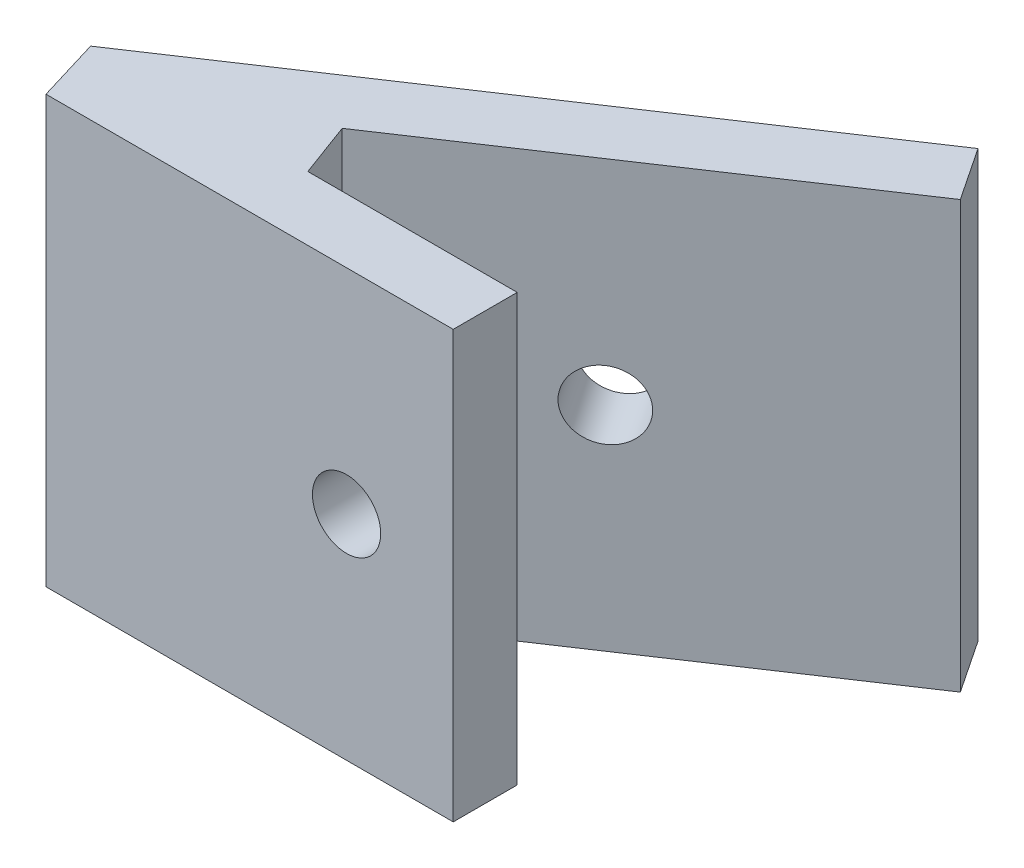
ISO-10303-21;
HEADER;
FILE_DESCRIPTION(('STEP AP214'),'2;1');
FILE_NAME('part.step','',(''),(''),'','','');
FILE_SCHEMA(('AUTOMOTIVE_DESIGN { 1 0 10303 214 1 1 1 1 }'));
ENDSEC;
DATA;
#1=APPLICATION_CONTEXT('core data for automotive mechanical design processes');
#2=APPLICATION_PROTOCOL_DEFINITION('international standard','automotive_design',2000,#1);
#3=PRODUCT_CONTEXT('',#1,'mechanical');
#4=PRODUCT('Part','Part','',(#3));
#5=PRODUCT_RELATED_PRODUCT_CATEGORY('part','',(#4));
#6=PRODUCT_DEFINITION_FORMATION('','',#4);
#7=PRODUCT_DEFINITION_CONTEXT('part definition',#1,'design');
#8=PRODUCT_DEFINITION('design','',#6,#7);
#9=PRODUCT_DEFINITION_SHAPE('','',#8);
#10=(LENGTH_UNIT() NAMED_UNIT(*) SI_UNIT(.MILLI.,.METRE.));
#11=(NAMED_UNIT(*) PLANE_ANGLE_UNIT() SI_UNIT($,.RADIAN.));
#12=(NAMED_UNIT(*) SI_UNIT($,.STERADIAN.) SOLID_ANGLE_UNIT());
#13=UNCERTAINTY_MEASURE_WITH_UNIT(LENGTH_MEASURE(1.E-05),#10,'distance_accuracy_value','');
#14=(GEOMETRIC_REPRESENTATION_CONTEXT(3) GLOBAL_UNCERTAINTY_ASSIGNED_CONTEXT((#13)) GLOBAL_UNIT_ASSIGNED_CONTEXT((#10,
#11,#12)) REPRESENTATION_CONTEXT('',''));
#15=CARTESIAN_POINT('',(0.,0.,0.));
#16=DIRECTION('',(0.,0.,1.));
#17=DIRECTION('',(1.,0.,0.));
#18=AXIS2_PLACEMENT_3D('',#15,#16,#17);
#19=CARTESIAN_POINT('',(22.9929854963961,20.,-80.3307949469992));
#20=DIRECTION('',(-1.,0.,0.));
#21=DIRECTION('',(0.,0.,1.));
#22=AXIS2_PLACEMENT_3D('',#19,#20,#21);
#23=PLANE('',#22);
#24=DIRECTION('',(0.,0.,-1.));
#25=VECTOR('',#24,1.);
#26=CARTESIAN_POINT('',(22.9929854963961,0.,-80.3307949469992));
#27=LINE('',#26,#25);
#28=CARTESIAN_POINT('',(22.9929854963961,0.,-80.3307949469992));
#29=VERTEX_POINT('',#28);
#30=CARTESIAN_POINT('',(22.9929854963961,0.,-83.3307949469992));
#31=VERTEX_POINT('',#30);
#32=EDGE_CURVE('E135',#29,#31,#27,.T.);
#33=ORIENTED_EDGE('',*,*,#32,.T.);
#34=DIRECTION('',(0.,-1.,0.));
#35=VECTOR('',#34,1.);
#36=CARTESIAN_POINT('',(22.9929854963961,20.,-83.3307949469992));
#37=LINE('',#36,#35);
#38=CARTESIAN_POINT('',(22.9929854963961,20.,-83.3307949469992));
#39=VERTEX_POINT('',#38);
#40=EDGE_CURVE('E11',#39,#31,#37,.T.);
#41=ORIENTED_EDGE('',*,*,#40,.F.);
#42=DIRECTION('',(0.,0.,-1.));
#43=VECTOR('',#42,1.);
#44=CARTESIAN_POINT('',(22.9929854963961,20.,-80.3307949469992));
#45=LINE('',#44,#43);
#46=CARTESIAN_POINT('',(22.9929854963961,20.,-80.3307949469992));
#47=VERTEX_POINT('',#46);
#48=EDGE_CURVE('E150',#47,#39,#45,.T.);
#49=ORIENTED_EDGE('',*,*,#48,.F.);
#50=DIRECTION('',(0.,-1.,0.));
#51=VECTOR('',#50,1.);
#52=CARTESIAN_POINT('',(22.9929854963961,20.,-80.3307949469992));
#53=LINE('',#52,#51);
#54=EDGE_CURVE('E131',#47,#29,#53,.T.);
#55=ORIENTED_EDGE('',*,*,#54,.T.);
#56=EDGE_LOOP('',(#33,#41,#49,#55));
#57=FACE_BOUND('',#56,.T.);
#58=ADVANCED_FACE('F39',(#57),#23,.F.);
#59=CARTESIAN_POINT('',(22.9929854963961,20.,-83.3307949469992));
#60=DIRECTION('',(0.,0.,1.));
#61=DIRECTION('',(1.,0.,0.));
#62=AXIS2_PLACEMENT_3D('',#59,#60,#61);
#63=PLANE('',#62);
#64=CARTESIAN_POINT('',(17.9929854963961,10.,-83.3307949469992));
#65=DIRECTION('',(0.,0.,-1.));
#66=DIRECTION('',(-1.,0.,0.));
#67=AXIS2_PLACEMENT_3D('',#64,#65,#66);
#68=CIRCLE('',#67,1.6);
#69=CARTESIAN_POINT('',(16.3929854963961,10.,-83.3307949469992));
#70=VERTEX_POINT('',#69);
#71=EDGE_CURVE('E183',#70,#70,#68,.T.);
#72=ORIENTED_EDGE('',*,*,#71,.F.);
#73=EDGE_LOOP('',(#72));
#74=FACE_BOUND('',#73,.T.);
#75=DIRECTION('',(-1.,0.,0.));
#76=VECTOR('',#75,1.);
#77=CARTESIAN_POINT('',(22.9929854963961,0.,-83.3307949469992));
#78=LINE('',#77,#76);
#79=CARTESIAN_POINT('',(13.1761345150598,0.,-83.3307949469992));
#80=VERTEX_POINT('',#79);
#81=EDGE_CURVE('E138',#31,#80,#78,.T.);
#82=ORIENTED_EDGE('',*,*,#81,.T.);
#83=DIRECTION('',(0.,-1.,0.));
#84=VECTOR('',#83,1.);
#85=CARTESIAN_POINT('',(13.1761345150598,20.,-83.3307949469992));
#86=LINE('',#85,#84);
#87=CARTESIAN_POINT('',(13.1761345150598,20.,-83.3307949469992));
#88=VERTEX_POINT('',#87);
#89=EDGE_CURVE('E47',#88,#80,#86,.T.);
#90=ORIENTED_EDGE('',*,*,#89,.F.);
#91=DIRECTION('',(-1.,0.,0.));
#92=VECTOR('',#91,1.);
#93=CARTESIAN_POINT('',(22.9929854963961,20.,-83.3307949469992));
#94=LINE('',#93,#92);
#95=EDGE_CURVE('E98',#39,#88,#94,.T.);
#96=ORIENTED_EDGE('',*,*,#95,.F.);
#97=ORIENTED_EDGE('',*,*,#40,.T.);
#98=EDGE_LOOP('',(#82,#90,#96,#97));
#99=FACE_BOUND('',#98,.T.);
#100=ADVANCED_FACE('F208',(#74,#99),#63,.F.);
#101=CARTESIAN_POINT('',(13.1761345150598,20.,-83.3307949469992));
#102=DIRECTION('',(-0.937949562999881,0.,0.34677170771032));
#103=DIRECTION('',(0.34677170771032,0.,0.937949562999881));
#104=AXIS2_PLACEMENT_3D('',#101,#102,#103);
#105=PLANE('',#104);
#106=DIRECTION('',(-0.34677170771032,0.,-0.937949562999881));
#107=VECTOR('',#106,1.);
#108=CARTESIAN_POINT('',(13.1761345150598,0.,-83.3307949469992));
#109=LINE('',#108,#107);
#110=CARTESIAN_POINT('',(12.2298403237316,0.,-85.8903354270635));
#111=VERTEX_POINT('',#110);
#112=EDGE_CURVE('E141',#80,#111,#109,.T.);
#113=ORIENTED_EDGE('',*,*,#112,.T.);
#114=DIRECTION('',(0.,-1.,0.));
#115=VECTOR('',#114,1.);
#116=CARTESIAN_POINT('',(12.2298403237316,20.,-85.8903354270635));
#117=LINE('',#116,#115);
#118=CARTESIAN_POINT('',(12.2298403237316,20.,-85.8903354270635));
#119=VERTEX_POINT('',#118);
#120=EDGE_CURVE('E157',#119,#111,#117,.T.);
#121=ORIENTED_EDGE('',*,*,#120,.F.);
#122=DIRECTION('',(-0.34677170771032,0.,-0.937949562999881));
#123=VECTOR('',#122,1.);
#124=CARTESIAN_POINT('',(13.1761345150598,20.,-83.3307949469992));
#125=LINE('',#124,#123);
#126=EDGE_CURVE('E165',#88,#119,#125,.T.);
#127=ORIENTED_EDGE('',*,*,#126,.F.);
#128=ORIENTED_EDGE('',*,*,#89,.T.);
#129=EDGE_LOOP('',(#113,#121,#127,#128));
#130=FACE_BOUND('',#129,.T.);
#131=ADVANCED_FACE('F163',(#130),#105,.F.);
#132=CARTESIAN_POINT('',(29.6110047686621,20.,-97.48703517056));
#133=DIRECTION('',(-0.555006865090158,0.,-0.831845766775786));
#134=DIRECTION('',(-0.831845766775786,0.,0.555006865090158));
#135=AXIS2_PLACEMENT_3D('',#132,#133,#134);
#136=PLANE('',#135);
#137=CARTESIAN_POINT('',(19.6288548891788,10.,-90.8269523370011));
#138=DIRECTION('',(-0.555006865090158,0.,-0.831845766775786));
#139=DIRECTION('',(0.831845766775786,0.,-0.555006865090158));
#140=AXIS2_PLACEMENT_3D('',#137,#138,#139);
#141=ELLIPSE('',#140,1.60000010870187,1.60000000000001);
#142=CARTESIAN_POINT('',(20.9598082064433,10.,-91.7149633814756));
#143=VERTEX_POINT('',#142);
#144=EDGE_CURVE('E186',#143,#143,#141,.F.);
#145=ORIENTED_EDGE('',*,*,#144,.F.);
#146=EDGE_LOOP('',(#145));
#147=FACE_BOUND('',#146,.T.);
#148=DIRECTION('',(0.831845766775786,0.,-0.555006865090158));
#149=VECTOR('',#148,1.);
#150=CARTESIAN_POINT('',(29.6110047686621,0.,-97.48703517056));
#151=LINE('',#150,#149);
#152=CARTESIAN_POINT('',(29.6110047686621,0.,-97.48703517056));
#153=VERTEX_POINT('',#152);
#154=EDGE_CURVE('E143',#111,#153,#151,.T.);
#155=ORIENTED_EDGE('',*,*,#154,.T.);
#156=DIRECTION('',(0.,-1.,0.));
#157=VECTOR('',#156,1.);
#158=CARTESIAN_POINT('',(29.6110047686621,20.,-97.48703517056));
#159=LINE('',#158,#157);
#160=CARTESIAN_POINT('',(29.6110047686621,20.,-97.48703517056));
#161=VERTEX_POINT('',#160);
#162=EDGE_CURVE('E154',#161,#153,#159,.T.);
#163=ORIENTED_EDGE('',*,*,#162,.F.);
#164=DIRECTION('',(0.831845766775786,0.,-0.555006865090158));
#165=VECTOR('',#164,1.);
#166=CARTESIAN_POINT('',(29.6110047686621,20.,-97.48703517056));
#167=LINE('',#166,#165);
#168=EDGE_CURVE('E177',#119,#161,#167,.T.);
#169=ORIENTED_EDGE('',*,*,#168,.F.);
#170=ORIENTED_EDGE('',*,*,#120,.T.);
#171=EDGE_LOOP('',(#155,#163,#169,#170));
#172=FACE_BOUND('',#171,.T.);
#173=ADVANCED_FACE('F173',(#147,#172),#136,.F.);
#174=CARTESIAN_POINT('',(27.9544943265313,20.,-99.9718008337562));
#175=DIRECTION('',(-0.832050294337841,0.,0.554700196225234));
#176=DIRECTION('',(0.554700196225234,0.,0.832050294337841));
#177=AXIS2_PLACEMENT_3D('',#174,#175,#176);
#178=PLANE('',#177);
#179=DIRECTION('',(-0.554700196225234,0.,-0.832050294337841));
#180=VECTOR('',#179,1.);
#181=CARTESIAN_POINT('',(27.9544943265313,0.,-99.9718008337562));
#182=LINE('',#181,#180);
#183=CARTESIAN_POINT('',(27.9544943265313,0.,-99.9718008337562));
#184=VERTEX_POINT('',#183);
#185=EDGE_CURVE('E145',#153,#184,#182,.T.);
#186=ORIENTED_EDGE('',*,*,#185,.T.);
#187=DIRECTION('',(0.,-1.,0.));
#188=VECTOR('',#187,1.);
#189=CARTESIAN_POINT('',(27.9544943265313,20.,-99.9718008337562));
#190=LINE('',#189,#188);
#191=CARTESIAN_POINT('',(27.9544943265313,20.,-99.9718008337562));
#192=VERTEX_POINT('',#191);
#193=EDGE_CURVE('E126',#192,#184,#190,.T.);
#194=ORIENTED_EDGE('',*,*,#193,.F.);
#195=DIRECTION('',(-0.554700196225234,0.,-0.832050294337841));
#196=VECTOR('',#195,1.);
#197=CARTESIAN_POINT('',(27.9544943265313,20.,-99.9718008337562));
#198=LINE('',#197,#196);
#199=EDGE_CURVE('E117',#161,#192,#198,.T.);
#200=ORIENTED_EDGE('',*,*,#199,.F.);
#201=ORIENTED_EDGE('',*,*,#162,.T.);
#202=EDGE_LOOP('',(#186,#194,#200,#201));
#203=FACE_BOUND('',#202,.T.);
#204=ADVANCED_FACE('F176',(#203),#178,.F.);
#205=CARTESIAN_POINT('',(2.99298549639611,20.,-83.3307949469992));
#206=DIRECTION('',(0.554700196225233,0.,0.832050294337841));
#207=DIRECTION('',(0.832050294337841,0.,-0.554700196225233));
#208=AXIS2_PLACEMENT_3D('',#205,#206,#207);
#209=PLANE('',#208);
#210=CARTESIAN_POINT('',(17.9698907944773,10.,-93.3153984790534));
#211=DIRECTION('',(-0.554700196225231,0.,-0.832050294337843));
#212=DIRECTION('',(-0.832050294337843,0.,0.554700196225231));
#213=AXIS2_PLACEMENT_3D('',#210,#211,#212);
#214=CIRCLE('',#213,1.60000000000001);
#215=CARTESIAN_POINT('',(16.6386103235367,10.,-92.427878165093));
#216=VERTEX_POINT('',#215);
#217=EDGE_CURVE('E191',#216,#216,#214,.T.);
#218=ORIENTED_EDGE('',*,*,#217,.F.);
#219=EDGE_LOOP('',(#218));
#220=FACE_BOUND('',#219,.T.);
#221=DIRECTION('',(-0.832050294337841,0.,0.554700196225233));
#222=VECTOR('',#221,1.);
#223=CARTESIAN_POINT('',(2.99298549639611,0.,-83.3307949469992));
#224=LINE('',#223,#222);
#225=CARTESIAN_POINT('',(2.99298549639611,0.,-83.3307949469992));
#226=VERTEX_POINT('',#225);
#227=EDGE_CURVE('E125',#184,#226,#224,.T.);
#228=ORIENTED_EDGE('',*,*,#227,.T.);
#229=DIRECTION('',(0.,-1.,0.));
#230=VECTOR('',#229,1.);
#231=CARTESIAN_POINT('',(2.99298549639611,20.,-83.3307949469992));
#232=LINE('',#231,#230);
#233=CARTESIAN_POINT('',(2.99298549639611,20.,-83.3307949469992));
#234=VERTEX_POINT('',#233);
#235=EDGE_CURVE('E122',#234,#226,#232,.T.);
#236=ORIENTED_EDGE('',*,*,#235,.F.);
#237=DIRECTION('',(-0.832050294337841,0.,0.554700196225233));
#238=VECTOR('',#237,1.);
#239=CARTESIAN_POINT('',(2.99298549639611,20.,-83.3307949469992));
#240=LINE('',#239,#238);
#241=EDGE_CURVE('E111',#192,#234,#240,.T.);
#242=ORIENTED_EDGE('',*,*,#241,.F.);
#243=ORIENTED_EDGE('',*,*,#193,.T.);
#244=EDGE_LOOP('',(#228,#236,#242,#243));
#245=FACE_BOUND('',#244,.T.);
#246=ADVANCED_FACE('F123',(#220,#245),#209,.F.);
#247=CARTESIAN_POINT('',(2.99298549639611,20.,-83.3307949469992));
#248=DIRECTION('',(0.957092026489052,0.,-0.289784148688432));
#249=DIRECTION('',(-0.289784148688432,0.,-0.957092026489052));
#250=AXIS2_PLACEMENT_3D('',#247,#248,#249);
#251=PLANE('',#250);
#252=DIRECTION('',(0.289784148688432,0.,0.957092026489052));
#253=VECTOR('',#252,1.);
#254=CARTESIAN_POINT('',(2.99298549639611,0.,-83.3307949469992));
#255=LINE('',#254,#253);
#256=CARTESIAN_POINT('',(3.90131240959211,0.,-80.3307949469992));
#257=VERTEX_POINT('',#256);
#258=EDGE_CURVE('E84',#226,#257,#255,.T.);
#259=ORIENTED_EDGE('',*,*,#258,.T.);
#260=DIRECTION('',(0.,-1.,0.));
#261=VECTOR('',#260,1.);
#262=CARTESIAN_POINT('',(3.90131240959211,20.,-80.3307949469992));
#263=LINE('',#262,#261);
#264=CARTESIAN_POINT('',(3.90131240959211,20.,-80.3307949469992));
#265=VERTEX_POINT('',#264);
#266=EDGE_CURVE('E127',#265,#257,#263,.T.);
#267=ORIENTED_EDGE('',*,*,#266,.F.);
#268=DIRECTION('',(0.289784148688432,0.,0.957092026489052));
#269=VECTOR('',#268,1.);
#270=CARTESIAN_POINT('',(2.99298549639611,20.,-83.3307949469992));
#271=LINE('',#270,#269);
#272=EDGE_CURVE('E115',#234,#265,#271,.T.);
#273=ORIENTED_EDGE('',*,*,#272,.F.);
#274=ORIENTED_EDGE('',*,*,#235,.T.);
#275=EDGE_LOOP('',(#259,#267,#273,#274));
#276=FACE_BOUND('',#275,.T.);
#277=ADVANCED_FACE('F129',(#276),#251,.F.);
#278=CARTESIAN_POINT('',(3.90131240959211,20.,-80.3307949469992));
#279=DIRECTION('',(0.,0.,-1.));
#280=DIRECTION('',(-1.,0.,0.));
#281=AXIS2_PLACEMENT_3D('',#278,#279,#280);
#282=PLANE('',#281);
#283=CARTESIAN_POINT('',(17.9929854963961,10.,-80.3307949469992));
#284=DIRECTION('',(0.,0.,-1.));
#285=DIRECTION('',(-1.,0.,0.));
#286=AXIS2_PLACEMENT_3D('',#283,#284,#285);
#287=CIRCLE('',#286,1.6);
#288=CARTESIAN_POINT('',(16.3929854963961,10.,-80.3307949469992));
#289=VERTEX_POINT('',#288);
#290=EDGE_CURVE('E139',#289,#289,#287,.T.);
#291=ORIENTED_EDGE('',*,*,#290,.T.);
#292=EDGE_LOOP('',(#291));
#293=FACE_BOUND('',#292,.T.);
#294=DIRECTION('',(1.,0.,0.));
#295=VECTOR('',#294,1.);
#296=CARTESIAN_POINT('',(3.90131240959211,0.,-80.3307949469992));
#297=LINE('',#296,#295);
#298=EDGE_CURVE('E90',#257,#29,#297,.T.);
#299=ORIENTED_EDGE('',*,*,#298,.T.);
#300=ORIENTED_EDGE('',*,*,#54,.F.);
#301=DIRECTION('',(1.,0.,0.));
#302=VECTOR('',#301,1.);
#303=CARTESIAN_POINT('',(3.90131240959211,20.,-80.3307949469992));
#304=LINE('',#303,#302);
#305=EDGE_CURVE('E55',#265,#47,#304,.T.);
#306=ORIENTED_EDGE('',*,*,#305,.F.);
#307=ORIENTED_EDGE('',*,*,#266,.T.);
#308=EDGE_LOOP('',(#299,#300,#306,#307));
#309=FACE_BOUND('',#308,.T.);
#310=ADVANCED_FACE('F204',(#293,#309),#282,.F.);
#311=CARTESIAN_POINT('',(0.,20.,0.));
#312=DIRECTION('',(0.,1.,0.));
#313=DIRECTION('',(0.,0.,1.));
#314=AXIS2_PLACEMENT_3D('',#311,#312,#313);
#315=PLANE('',#314);
#316=ORIENTED_EDGE('',*,*,#48,.T.);
#317=ORIENTED_EDGE('',*,*,#95,.T.);
#318=ORIENTED_EDGE('',*,*,#126,.T.);
#319=ORIENTED_EDGE('',*,*,#168,.T.);
#320=ORIENTED_EDGE('',*,*,#199,.T.);
#321=ORIENTED_EDGE('',*,*,#241,.T.);
#322=ORIENTED_EDGE('',*,*,#272,.T.);
#323=ORIENTED_EDGE('',*,*,#305,.T.);
#324=EDGE_LOOP('',(#316,#317,#318,#319,#320,#321,#322,#323));
#325=FACE_BOUND('',#324,.T.);
#326=ADVANCED_FACE('F113',(#325),#315,.T.);
#327=CARTESIAN_POINT('',(0.,0.,0.));
#328=DIRECTION('',(0.,1.,0.));
#329=DIRECTION('',(0.,0.,1.));
#330=AXIS2_PLACEMENT_3D('',#327,#328,#329);
#331=PLANE('',#330);
#332=ORIENTED_EDGE('',*,*,#32,.F.);
#333=ORIENTED_EDGE('',*,*,#298,.F.);
#334=ORIENTED_EDGE('',*,*,#258,.F.);
#335=ORIENTED_EDGE('',*,*,#227,.F.);
#336=ORIENTED_EDGE('',*,*,#185,.F.);
#337=ORIENTED_EDGE('',*,*,#154,.F.);
#338=ORIENTED_EDGE('',*,*,#112,.F.);
#339=ORIENTED_EDGE('',*,*,#81,.F.);
#340=EDGE_LOOP('',(#332,#333,#334,#335,#336,#337,#338,#339));
#341=FACE_BOUND('',#340,.T.);
#342=ADVANCED_FACE('F169',(#341),#331,.F.);
#343=CARTESIAN_POINT('',(17.9929854963961,10.,-80.3307949469992));
#344=DIRECTION('',(0.,0.,-1.));
#345=DIRECTION('',(-1.,0.,0.));
#346=AXIS2_PLACEMENT_3D('',#343,#344,#345);
#347=CYLINDRICAL_SURFACE('',#346,1.6);
#348=ORIENTED_EDGE('',*,*,#290,.F.);
#349=EDGE_LOOP('',(#348));
#350=FACE_BOUND('',#349,.T.);
#351=ORIENTED_EDGE('',*,*,#71,.T.);
#352=EDGE_LOOP('',(#351));
#353=FACE_BOUND('',#352,.T.);
#354=ADVANCED_FACE('F225',(#350,#353),#347,.F.);
#355=CARTESIAN_POINT('',(27.5454351859438,10.,-78.9520818918536));
#356=DIRECTION('',(-0.554700196225231,0.,-0.832050294337842));
#357=DIRECTION('',(-0.832050294337843,0.,0.554700196225231));
#358=AXIS2_PLACEMENT_3D('',#355,#356,#357);
#359=CYLINDRICAL_SURFACE('',#358,1.60000000000001);
#360=ORIENTED_EDGE('',*,*,#217,.T.);
#361=EDGE_LOOP('',(#360));
#362=FACE_BOUND('',#361,.T.);
#363=ORIENTED_EDGE('',*,*,#144,.T.);
#364=EDGE_LOOP('',(#363));
#365=FACE_BOUND('',#364,.T.);
#366=ADVANCED_FACE('F195',(#362,#365),#359,.F.);
#367=CLOSED_SHELL('',(#58,#100,#131,#173,#204,#246,#277,#310,#326,#342,#354,#366));
#368=MANIFOLD_SOLID_BREP('B2',#367);
#369=ADVANCED_BREP_SHAPE_REPRESENTATION('',(#18,#368),#14);
#370=SHAPE_DEFINITION_REPRESENTATION(#9,#369);
ENDSEC;
END-ISO-10303-21;
